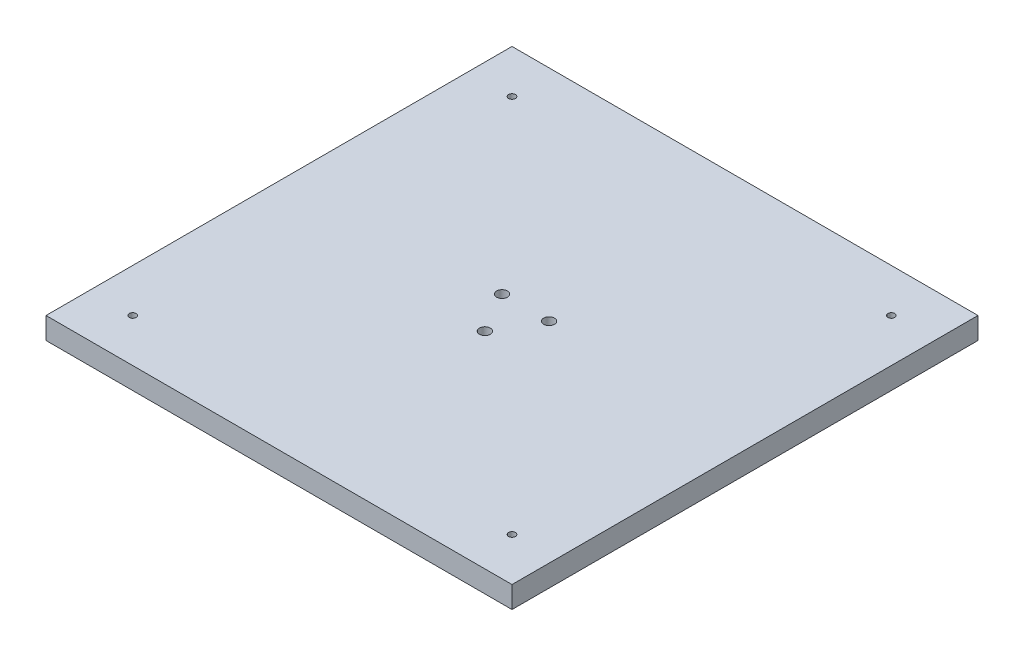
ISO-10303-21;
HEADER;
FILE_DESCRIPTION(('STEP AP214'),'2;1');
FILE_NAME('part.step','',(''),(''),'','','');
FILE_SCHEMA(('AUTOMOTIVE_DESIGN { 1 0 10303 214 1 1 1 1 }'));
ENDSEC;
DATA;
#1=APPLICATION_CONTEXT('core data for automotive mechanical design processes');
#2=APPLICATION_PROTOCOL_DEFINITION('international standard','automotive_design',2000,#1);
#3=PRODUCT_CONTEXT('',#1,'mechanical');
#4=PRODUCT('Part','Part','',(#3));
#5=PRODUCT_RELATED_PRODUCT_CATEGORY('part','',(#4));
#6=PRODUCT_DEFINITION_FORMATION('','',#4);
#7=PRODUCT_DEFINITION_CONTEXT('part definition',#1,'design');
#8=PRODUCT_DEFINITION('design','',#6,#7);
#9=PRODUCT_DEFINITION_SHAPE('','',#8);
#10=(LENGTH_UNIT() NAMED_UNIT(*) SI_UNIT(.MILLI.,.METRE.));
#11=(NAMED_UNIT(*) PLANE_ANGLE_UNIT() SI_UNIT($,.RADIAN.));
#12=(NAMED_UNIT(*) SI_UNIT($,.STERADIAN.) SOLID_ANGLE_UNIT());
#13=UNCERTAINTY_MEASURE_WITH_UNIT(LENGTH_MEASURE(1.E-05),#10,'distance_accuracy_value','');
#14=(GEOMETRIC_REPRESENTATION_CONTEXT(3) GLOBAL_UNCERTAINTY_ASSIGNED_CONTEXT((#13)) GLOBAL_UNIT_ASSIGNED_CONTEXT((#10,
#11,#12)) REPRESENTATION_CONTEXT('',''));
#15=CARTESIAN_POINT('',(0.,0.,0.));
#16=DIRECTION('',(0.,0.,1.));
#17=DIRECTION('',(1.,0.,0.));
#18=AXIS2_PLACEMENT_3D('',#15,#16,#17);
#19=CARTESIAN_POINT('',(0.,70.,0.));
#20=DIRECTION('',(0.,1.,0.));
#21=DIRECTION('',(0.,0.,1.));
#22=AXIS2_PLACEMENT_3D('',#19,#20,#21);
#23=PLANE('',#22);
#24=CARTESIAN_POINT('',(-87.4999999999997,70.,87.5000000000003));
#25=DIRECTION('',(0.,1.,0.));
#26=DIRECTION('',(1.,0.,0.));
#27=AXIS2_PLACEMENT_3D('',#24,#25,#26);
#28=CIRCLE('',#27,1.60000000000001);
#29=CARTESIAN_POINT('',(-85.8999999999997,70.,87.5000000000003));
#30=VERTEX_POINT('',#29);
#31=EDGE_CURVE('E248',#30,#30,#28,.T.);
#32=ORIENTED_EDGE('',*,*,#31,.F.);
#33=EDGE_LOOP('',(#32));
#34=FACE_BOUND('',#33,.T.);
#35=CARTESIAN_POINT('',(87.5,70.,87.5));
#36=DIRECTION('',(0.,1.,0.));
#37=DIRECTION('',(0.,0.,-1.));
#38=AXIS2_PLACEMENT_3D('',#35,#36,#37);
#39=CIRCLE('',#38,1.60000000000001);
#40=CARTESIAN_POINT('',(87.5,70.,85.9));
#41=VERTEX_POINT('',#40);
#42=EDGE_CURVE('E240',#41,#41,#39,.T.);
#43=ORIENTED_EDGE('',*,*,#42,.F.);
#44=EDGE_LOOP('',(#43));
#45=FACE_BOUND('',#44,.T.);
#46=CARTESIAN_POINT('',(87.4999999999991,70.,-87.5000000000009));
#47=DIRECTION('',(0.,1.,0.));
#48=DIRECTION('',(-1.,0.,0.));
#49=AXIS2_PLACEMENT_3D('',#46,#47,#48);
#50=CIRCLE('',#49,1.60000000000001);
#51=CARTESIAN_POINT('',(85.8999999999991,70.,-87.5000000000009));
#52=VERTEX_POINT('',#51);
#53=EDGE_CURVE('E232',#52,#52,#50,.T.);
#54=ORIENTED_EDGE('',*,*,#53,.F.);
#55=EDGE_LOOP('',(#54));
#56=FACE_BOUND('',#55,.T.);
#57=CARTESIAN_POINT('',(-87.5,70.,-87.5));
#58=DIRECTION('',(0.,1.,0.));
#59=DIRECTION('',(0.,0.,1.));
#60=AXIS2_PLACEMENT_3D('',#57,#58,#59);
#61=CIRCLE('',#60,1.60000000000001);
#62=CARTESIAN_POINT('',(-87.5,70.,-85.9));
#63=VERTEX_POINT('',#62);
#64=EDGE_CURVE('E224',#63,#63,#61,.T.);
#65=ORIENTED_EDGE('',*,*,#64,.F.);
#66=EDGE_LOOP('',(#65));
#67=FACE_BOUND('',#66,.T.);
#68=CARTESIAN_POINT('',(0.,70.,12.525));
#69=DIRECTION('',(0.,-1.,0.));
#70=DIRECTION('',(-0.866025403784436,0.,0.500000000000004));
#71=AXIS2_PLACEMENT_3D('',#68,#69,#70);
#72=CIRCLE('',#71,2.5);
#73=CARTESIAN_POINT('',(0.,70.,10.025));
#74=VERTEX_POINT('',#73);
#75=EDGE_CURVE('E167',#74,#74,#72,.T.);
#76=ORIENTED_EDGE('',*,*,#75,.T.);
#77=EDGE_LOOP('',(#76));
#78=FACE_BOUND('',#77,.T.);
#79=CARTESIAN_POINT('',(10.8469681824001,70.,-6.26250000000005));
#80=DIRECTION('',(0.,-1.,0.));
#81=DIRECTION('',(0.866025403784443,0.,0.499999999999992));
#82=AXIS2_PLACEMENT_3D('',#79,#80,#81);
#83=CIRCLE('',#82,2.5);
#84=CARTESIAN_POINT('',(10.8469681824001,70.,-8.76250000000005));
#85=VERTEX_POINT('',#84);
#86=EDGE_CURVE('E168',#85,#85,#83,.T.);
#87=ORIENTED_EDGE('',*,*,#86,.T.);
#88=EDGE_LOOP('',(#87));
#89=FACE_BOUND('',#88,.T.);
#90=CARTESIAN_POINT('',(-10.8469681824001,70.,-6.26250000000005));
#91=DIRECTION('',(0.,-1.,0.));
#92=DIRECTION('',(0.,0.,-1.));
#93=AXIS2_PLACEMENT_3D('',#90,#91,#92);
#94=CIRCLE('',#93,2.5);
#95=CARTESIAN_POINT('',(-10.8469681824001,70.,-8.76250000000004));
#96=VERTEX_POINT('',#95);
#97=EDGE_CURVE('E155',#96,#96,#94,.T.);
#98=ORIENTED_EDGE('',*,*,#97,.T.);
#99=EDGE_LOOP('',(#98));
#100=FACE_BOUND('',#99,.T.);
#101=DIRECTION('',(1.,0.,0.));
#102=VECTOR('',#101,1.);
#103=CARTESIAN_POINT('',(0.,70.,107.5));
#104=LINE('',#103,#102);
#105=CARTESIAN_POINT('',(-107.5,70.,107.5));
#106=VERTEX_POINT('',#105);
#107=CARTESIAN_POINT('',(107.5,70.,107.5));
#108=VERTEX_POINT('',#107);
#109=EDGE_CURVE('E196',#106,#108,#104,.T.);
#110=ORIENTED_EDGE('',*,*,#109,.T.);
#111=DIRECTION('',(0.,0.,-1.));
#112=VECTOR('',#111,1.);
#113=CARTESIAN_POINT('',(107.5,70.,0.));
#114=LINE('',#113,#112);
#115=CARTESIAN_POINT('',(107.5,70.,-107.5));
#116=VERTEX_POINT('',#115);
#117=EDGE_CURVE('E217',#108,#116,#114,.T.);
#118=ORIENTED_EDGE('',*,*,#117,.T.);
#119=DIRECTION('',(1.,0.,0.));
#120=VECTOR('',#119,1.);
#121=CARTESIAN_POINT('',(0.,70.,-107.5));
#122=LINE('',#121,#120);
#123=CARTESIAN_POINT('',(-107.5,70.,-107.5));
#124=VERTEX_POINT('',#123);
#125=EDGE_CURVE('E213',#124,#116,#122,.T.);
#126=ORIENTED_EDGE('',*,*,#125,.F.);
#127=DIRECTION('',(0.,0.,-1.));
#128=VECTOR('',#127,1.);
#129=CARTESIAN_POINT('',(-107.5,70.,0.));
#130=LINE('',#129,#128);
#131=EDGE_CURVE('E191',#106,#124,#130,.T.);
#132=ORIENTED_EDGE('',*,*,#131,.F.);
#133=EDGE_LOOP('',(#110,#118,#126,#132));
#134=FACE_BOUND('',#133,.T.);
#135=ADVANCED_FACE('F57',(#34,#45,#56,#67,#78,#89,#100,#134),#23,.T.);
#136=CARTESIAN_POINT('',(0.,45.,0.));
#137=DIRECTION('',(0.,1.,0.));
#138=DIRECTION('',(0.,0.,1.));
#139=AXIS2_PLACEMENT_3D('',#136,#137,#138);
#140=PLANE('',#139);
#141=CARTESIAN_POINT('',(-10.8469681824001,45.,-6.26250000000005));
#142=DIRECTION('',(0.,1.,0.));
#143=DIRECTION('',(0.,0.,1.));
#144=AXIS2_PLACEMENT_3D('',#141,#142,#143);
#145=CIRCLE('',#144,2.5);
#146=CARTESIAN_POINT('',(-10.8469681824001,45.,-8.76250000000004));
#147=VERTEX_POINT('',#146);
#148=EDGE_CURVE('E145',#147,#147,#145,.T.);
#149=ORIENTED_EDGE('',*,*,#148,.T.);
#150=EDGE_LOOP('',(#149));
#151=FACE_BOUND('',#150,.T.);
#152=CARTESIAN_POINT('',(0.,45.,0.));
#153=DIRECTION('',(0.,1.,0.));
#154=DIRECTION('',(0.,0.,1.));
#155=AXIS2_PLACEMENT_3D('',#152,#153,#154);
#156=CIRCLE('',#155,6.);
#157=CARTESIAN_POINT('',(-2.,45.,-5.65685424949238));
#158=VERTEX_POINT('',#157);
#159=CARTESIAN_POINT('',(2.,45.,-5.65685424949238));
#160=VERTEX_POINT('',#159);
#161=EDGE_CURVE('E142',#158,#160,#156,.T.);
#162=ORIENTED_EDGE('',*,*,#161,.T.);
#163=DIRECTION('',(0.,0.,1.));
#164=VECTOR('',#163,1.);
#165=CARTESIAN_POINT('',(2.,45.,0.));
#166=LINE('',#165,#164);
#167=CARTESIAN_POINT('',(2.,45.,-8.));
#168=VERTEX_POINT('',#167);
#169=EDGE_CURVE('E114',#168,#160,#166,.T.);
#170=ORIENTED_EDGE('',*,*,#169,.F.);
#171=DIRECTION('',(1.,0.,0.));
#172=VECTOR('',#171,1.);
#173=CARTESIAN_POINT('',(0.,45.,-8.));
#174=LINE('',#173,#172);
#175=CARTESIAN_POINT('',(-2.,45.,-8.));
#176=VERTEX_POINT('',#175);
#177=EDGE_CURVE('E110',#176,#168,#174,.T.);
#178=ORIENTED_EDGE('',*,*,#177,.F.);
#179=DIRECTION('',(0.,0.,1.));
#180=VECTOR('',#179,1.);
#181=CARTESIAN_POINT('',(-2.,45.,0.));
#182=LINE('',#181,#180);
#183=EDGE_CURVE('E115',#176,#158,#182,.T.);
#184=ORIENTED_EDGE('',*,*,#183,.T.);
#185=EDGE_LOOP('',(#162,#170,#178,#184));
#186=FACE_BOUND('',#185,.T.);
#187=CARTESIAN_POINT('',(0.,45.,0.));
#188=DIRECTION('',(0.,1.,0.));
#189=DIRECTION('',(0.,0.,1.));
#190=AXIS2_PLACEMENT_3D('',#187,#188,#189);
#191=CIRCLE('',#190,19.05);
#192=CARTESIAN_POINT('',(0.,45.,19.05));
#193=VERTEX_POINT('',#192);
#194=EDGE_CURVE('E126',#193,#193,#191,.T.);
#195=ORIENTED_EDGE('',*,*,#194,.F.);
#196=EDGE_LOOP('',(#195));
#197=FACE_BOUND('',#196,.T.);
#198=CARTESIAN_POINT('',(0.,45.,12.525));
#199=DIRECTION('',(0.,1.,0.));
#200=DIRECTION('',(0.,0.,1.));
#201=AXIS2_PLACEMENT_3D('',#198,#199,#200);
#202=CIRCLE('',#201,2.5);
#203=CARTESIAN_POINT('',(0.,45.,10.025));
#204=VERTEX_POINT('',#203);
#205=EDGE_CURVE('E159',#204,#204,#202,.T.);
#206=ORIENTED_EDGE('',*,*,#205,.T.);
#207=EDGE_LOOP('',(#206));
#208=FACE_BOUND('',#207,.T.);
#209=CARTESIAN_POINT('',(10.8469681824001,45.,-6.26250000000005));
#210=DIRECTION('',(0.,1.,0.));
#211=DIRECTION('',(0.,0.,1.));
#212=AXIS2_PLACEMENT_3D('',#209,#210,#211);
#213=CIRCLE('',#212,2.5);
#214=CARTESIAN_POINT('',(10.8469681824001,45.,-8.76250000000005));
#215=VERTEX_POINT('',#214);
#216=EDGE_CURVE('E163',#215,#215,#213,.T.);
#217=ORIENTED_EDGE('',*,*,#216,.T.);
#218=EDGE_LOOP('',(#217));
#219=FACE_BOUND('',#218,.T.);
#220=ADVANCED_FACE('F268',(#151,#186,#197,#208,#219),#140,.F.);
#221=CARTESIAN_POINT('',(2.,42.,0.));
#222=DIRECTION('',(-1.,0.,0.));
#223=DIRECTION('',(0.,0.,1.));
#224=AXIS2_PLACEMENT_3D('',#221,#222,#223);
#225=PLANE('',#224);
#226=DIRECTION('',(0.,1.,0.));
#227=VECTOR('',#226,1.);
#228=CARTESIAN_POINT('',(2.,42.,-8.));
#229=LINE('',#228,#227);
#230=CARTESIAN_POINT('',(2.,42.,-8.));
#231=VERTEX_POINT('',#230);
#232=EDGE_CURVE('E105',#231,#168,#229,.T.);
#233=ORIENTED_EDGE('',*,*,#232,.T.);
#234=ORIENTED_EDGE('',*,*,#169,.T.);
#235=DIRECTION('',(0.,1.,0.));
#236=VECTOR('',#235,1.);
#237=CARTESIAN_POINT('',(2.,42.,-5.65685424949238));
#238=LINE('',#237,#236);
#239=CARTESIAN_POINT('',(2.,42.,-5.65685424949238));
#240=VERTEX_POINT('',#239);
#241=EDGE_CURVE('E76',#240,#160,#238,.T.);
#242=ORIENTED_EDGE('',*,*,#241,.F.);
#243=DIRECTION('',(0.,0.,1.));
#244=VECTOR('',#243,1.);
#245=CARTESIAN_POINT('',(2.,42.,0.));
#246=LINE('',#245,#244);
#247=EDGE_CURVE('E11',#231,#240,#246,.T.);
#248=ORIENTED_EDGE('',*,*,#247,.F.);
#249=EDGE_LOOP('',(#233,#234,#242,#248));
#250=FACE_BOUND('',#249,.T.);
#251=ADVANCED_FACE('F117',(#250),#225,.F.);
#252=CARTESIAN_POINT('',(0.,42.,-8.));
#253=DIRECTION('',(0.,0.,1.));
#254=DIRECTION('',(1.,0.,0.));
#255=AXIS2_PLACEMENT_3D('',#252,#253,#254);
#256=PLANE('',#255);
#257=DIRECTION('',(0.,1.,0.));
#258=VECTOR('',#257,1.);
#259=CARTESIAN_POINT('',(-2.,42.,-8.));
#260=LINE('',#259,#258);
#261=CARTESIAN_POINT('',(-2.,42.,-8.));
#262=VERTEX_POINT('',#261);
#263=EDGE_CURVE('E99',#262,#176,#260,.T.);
#264=ORIENTED_EDGE('',*,*,#263,.T.);
#265=ORIENTED_EDGE('',*,*,#177,.T.);
#266=ORIENTED_EDGE('',*,*,#232,.F.);
#267=DIRECTION('',(1.,0.,0.));
#268=VECTOR('',#267,1.);
#269=CARTESIAN_POINT('',(0.,42.,-8.));
#270=LINE('',#269,#268);
#271=EDGE_CURVE('E68',#262,#231,#270,.T.);
#272=ORIENTED_EDGE('',*,*,#271,.F.);
#273=EDGE_LOOP('',(#264,#265,#266,#272));
#274=FACE_BOUND('',#273,.T.);
#275=ADVANCED_FACE('F107',(#274),#256,.F.);
#276=CARTESIAN_POINT('',(-2.,42.,0.));
#277=DIRECTION('',(-1.,0.,0.));
#278=DIRECTION('',(0.,0.,1.));
#279=AXIS2_PLACEMENT_3D('',#276,#277,#278);
#280=PLANE('',#279);
#281=ORIENTED_EDGE('',*,*,#183,.F.);
#282=ORIENTED_EDGE('',*,*,#263,.F.);
#283=DIRECTION('',(0.,0.,1.));
#284=VECTOR('',#283,1.);
#285=CARTESIAN_POINT('',(-2.,42.,0.));
#286=LINE('',#285,#284);
#287=CARTESIAN_POINT('',(-2.,42.,-5.65685424949238));
#288=VERTEX_POINT('',#287);
#289=EDGE_CURVE('E120',#262,#288,#286,.T.);
#290=ORIENTED_EDGE('',*,*,#289,.T.);
#291=DIRECTION('',(0.,1.,0.));
#292=VECTOR('',#291,1.);
#293=CARTESIAN_POINT('',(-2.,42.,-5.65685424949238));
#294=LINE('',#293,#292);
#295=EDGE_CURVE('E131',#288,#158,#294,.T.);
#296=ORIENTED_EDGE('',*,*,#295,.T.);
#297=EDGE_LOOP('',(#281,#282,#290,#296));
#298=FACE_BOUND('',#297,.T.);
#299=ADVANCED_FACE('F354',(#298),#280,.T.);
#300=CARTESIAN_POINT('',(0.,42.,0.));
#301=DIRECTION('',(0.,1.,0.));
#302=DIRECTION('',(0.,0.,1.));
#303=AXIS2_PLACEMENT_3D('',#300,#301,#302);
#304=CYLINDRICAL_SURFACE('',#303,6.);
#305=ORIENTED_EDGE('',*,*,#161,.F.);
#306=ORIENTED_EDGE('',*,*,#295,.F.);
#307=CARTESIAN_POINT('',(0.,42.,0.));
#308=DIRECTION('',(0.,1.,0.));
#309=DIRECTION('',(0.,0.,1.));
#310=AXIS2_PLACEMENT_3D('',#307,#308,#309);
#311=CIRCLE('',#310,6.);
#312=EDGE_CURVE('E61',#288,#240,#311,.T.);
#313=ORIENTED_EDGE('',*,*,#312,.T.);
#314=ORIENTED_EDGE('',*,*,#241,.T.);
#315=EDGE_LOOP('',(#305,#306,#313,#314));
#316=FACE_BOUND('',#315,.T.);
#317=ADVANCED_FACE('F347',(#316),#304,.T.);
#318=CARTESIAN_POINT('',(0.,45.,0.));
#319=DIRECTION('',(0.,1.,0.));
#320=DIRECTION('',(0.,0.,1.));
#321=AXIS2_PLACEMENT_3D('',#318,#319,#320);
#322=CYLINDRICAL_SURFACE('',#321,19.05);
#323=ORIENTED_EDGE('',*,*,#194,.T.);
#324=EDGE_LOOP('',(#323));
#325=FACE_BOUND('',#324,.T.);
#326=CARTESIAN_POINT('',(0.,60.,0.));
#327=DIRECTION('',(0.,1.,0.));
#328=DIRECTION('',(0.,0.,1.));
#329=AXIS2_PLACEMENT_3D('',#326,#327,#328);
#330=CIRCLE('',#329,19.05);
#331=CARTESIAN_POINT('',(0.,60.,19.05));
#332=VERTEX_POINT('',#331);
#333=EDGE_CURVE('E122',#332,#332,#330,.T.);
#334=ORIENTED_EDGE('',*,*,#333,.F.);
#335=EDGE_LOOP('',(#334));
#336=FACE_BOUND('',#335,.T.);
#337=ADVANCED_FACE('F344',(#325,#336),#322,.T.);
#338=CARTESIAN_POINT('',(0.,60.,0.));
#339=DIRECTION('',(0.,1.,0.));
#340=DIRECTION('',(0.,0.,1.));
#341=AXIS2_PLACEMENT_3D('',#338,#339,#340);
#342=PLANE('',#341);
#343=CARTESIAN_POINT('',(-87.4999999999997,60.,87.5000000000003));
#344=DIRECTION('',(0.,1.,0.));
#345=DIRECTION('',(1.,0.,0.));
#346=AXIS2_PLACEMENT_3D('',#343,#344,#345);
#347=CIRCLE('',#346,1.60000000000001);
#348=CARTESIAN_POINT('',(-85.8999999999997,60.,87.5000000000003));
#349=VERTEX_POINT('',#348);
#350=EDGE_CURVE('E228',#349,#349,#347,.T.);
#351=ORIENTED_EDGE('',*,*,#350,.T.);
#352=EDGE_LOOP('',(#351));
#353=FACE_BOUND('',#352,.T.);
#354=CARTESIAN_POINT('',(87.5,60.,87.5));
#355=DIRECTION('',(0.,1.,0.));
#356=DIRECTION('',(0.,0.,-1.));
#357=AXIS2_PLACEMENT_3D('',#354,#355,#356);
#358=CIRCLE('',#357,1.60000000000001);
#359=CARTESIAN_POINT('',(87.5,60.,85.9));
#360=VERTEX_POINT('',#359);
#361=EDGE_CURVE('E244',#360,#360,#358,.T.);
#362=ORIENTED_EDGE('',*,*,#361,.T.);
#363=EDGE_LOOP('',(#362));
#364=FACE_BOUND('',#363,.T.);
#365=CARTESIAN_POINT('',(87.4999999999991,60.,-87.5000000000009));
#366=DIRECTION('',(0.,1.,0.));
#367=DIRECTION('',(-1.,0.,0.));
#368=AXIS2_PLACEMENT_3D('',#365,#366,#367);
#369=CIRCLE('',#368,1.60000000000001);
#370=CARTESIAN_POINT('',(85.8999999999991,60.,-87.5000000000009));
#371=VERTEX_POINT('',#370);
#372=EDGE_CURVE('E236',#371,#371,#369,.T.);
#373=ORIENTED_EDGE('',*,*,#372,.T.);
#374=EDGE_LOOP('',(#373));
#375=FACE_BOUND('',#374,.T.);
#376=CARTESIAN_POINT('',(-87.5,60.,-87.5));
#377=DIRECTION('',(0.,1.,0.));
#378=DIRECTION('',(0.,0.,1.));
#379=AXIS2_PLACEMENT_3D('',#376,#377,#378);
#380=CIRCLE('',#379,1.60000000000001);
#381=CARTESIAN_POINT('',(-87.5,60.,-85.9));
#382=VERTEX_POINT('',#381);
#383=EDGE_CURVE('E209',#382,#382,#380,.T.);
#384=ORIENTED_EDGE('',*,*,#383,.T.);
#385=EDGE_LOOP('',(#384));
#386=FACE_BOUND('',#385,.T.);
#387=ORIENTED_EDGE('',*,*,#333,.T.);
#388=EDGE_LOOP('',(#387));
#389=FACE_BOUND('',#388,.T.);
#390=DIRECTION('',(1.,0.,0.));
#391=VECTOR('',#390,1.);
#392=CARTESIAN_POINT('',(0.,60.,107.5));
#393=LINE('',#392,#391);
#394=CARTESIAN_POINT('',(-107.5,60.,107.5));
#395=VERTEX_POINT('',#394);
#396=CARTESIAN_POINT('',(107.5,60.,107.5));
#397=VERTEX_POINT('',#396);
#398=EDGE_CURVE('E205',#395,#397,#393,.T.);
#399=ORIENTED_EDGE('',*,*,#398,.F.);
#400=DIRECTION('',(0.,0.,-1.));
#401=VECTOR('',#400,1.);
#402=CARTESIAN_POINT('',(-107.5,60.,0.));
#403=LINE('',#402,#401);
#404=CARTESIAN_POINT('',(-107.5,60.,-107.5));
#405=VERTEX_POINT('',#404);
#406=EDGE_CURVE('E192',#395,#405,#403,.T.);
#407=ORIENTED_EDGE('',*,*,#406,.T.);
#408=DIRECTION('',(1.,0.,0.));
#409=VECTOR('',#408,1.);
#410=CARTESIAN_POINT('',(0.,60.,-107.5));
#411=LINE('',#410,#409);
#412=CARTESIAN_POINT('',(107.5,60.,-107.5));
#413=VERTEX_POINT('',#412);
#414=EDGE_CURVE('E197',#405,#413,#411,.T.);
#415=ORIENTED_EDGE('',*,*,#414,.T.);
#416=DIRECTION('',(0.,0.,-1.));
#417=VECTOR('',#416,1.);
#418=CARTESIAN_POINT('',(107.5,60.,0.));
#419=LINE('',#418,#417);
#420=EDGE_CURVE('E201',#397,#413,#419,.T.);
#421=ORIENTED_EDGE('',*,*,#420,.F.);
#422=EDGE_LOOP('',(#399,#407,#415,#421));
#423=FACE_BOUND('',#422,.T.);
#424=ADVANCED_FACE('F256',(#353,#364,#375,#386,#389,#423),#342,.F.);
#425=CARTESIAN_POINT('',(0.,42.,0.));
#426=DIRECTION('',(0.,1.,0.));
#427=DIRECTION('',(0.,0.,1.));
#428=AXIS2_PLACEMENT_3D('',#425,#426,#427);
#429=PLANE('',#428);
#430=ORIENTED_EDGE('',*,*,#312,.F.);
#431=ORIENTED_EDGE('',*,*,#289,.F.);
#432=ORIENTED_EDGE('',*,*,#271,.T.);
#433=ORIENTED_EDGE('',*,*,#247,.T.);
#434=EDGE_LOOP('',(#430,#431,#432,#433));
#435=FACE_BOUND('',#434,.T.);
#436=ADVANCED_FACE('F59',(#435),#429,.F.);
#437=CARTESIAN_POINT('',(-10.8469681824001,70.,-6.26250000000005));
#438=DIRECTION('',(0.,-1.,0.));
#439=DIRECTION('',(0.,0.,-1.));
#440=AXIS2_PLACEMENT_3D('',#437,#438,#439);
#441=CYLINDRICAL_SURFACE('',#440,2.5);
#442=CARTESIAN_POINT('',(-10.8469681824001,70.,-8.76250000000004));
#443=CARTESIAN_POINT('',(-10.8469681824001,69.7395833333333,-8.76250000000004));
#444=CARTESIAN_POINT('',(-10.8469681824001,69.4791666666667,-8.76250000000004));
#445=CARTESIAN_POINT('',(-10.8469681824001,68.9583333333333,-8.76250000000004));
#446=CARTESIAN_POINT('',(-10.8469681824001,68.6979166666667,-8.76250000000004));
#447=CARTESIAN_POINT('',(-10.8469681824001,68.1770833333333,-8.76250000000004));
#448=CARTESIAN_POINT('',(-10.8469681824001,67.9166666666667,-8.76250000000004));
#449=CARTESIAN_POINT('',(-10.8469681824001,67.3958333333333,-8.76250000000004));
#450=CARTESIAN_POINT('',(-10.8469681824001,67.1354166666667,-8.76250000000004));
#451=CARTESIAN_POINT('',(-10.8469681824001,66.6145833333333,-8.76250000000004));
#452=CARTESIAN_POINT('',(-10.8469681824001,66.3541666666667,-8.76250000000004));
#453=CARTESIAN_POINT('',(-10.8469681824001,65.8333333333333,-8.76250000000004));
#454=CARTESIAN_POINT('',(-10.8469681824001,65.5729166666667,-8.76250000000004));
#455=CARTESIAN_POINT('',(-10.8469681824001,65.0520833333333,-8.76250000000004));
#456=CARTESIAN_POINT('',(-10.8469681824001,64.7916666666667,-8.76250000000004));
#457=CARTESIAN_POINT('',(-10.8469681824001,64.2708333333333,-8.76250000000004));
#458=CARTESIAN_POINT('',(-10.8469681824001,64.0104166666667,-8.76250000000004));
#459=CARTESIAN_POINT('',(-10.8469681824001,63.4895833333333,-8.76250000000004));
#460=CARTESIAN_POINT('',(-10.8469681824001,63.2291666666667,-8.76250000000004));
#461=CARTESIAN_POINT('',(-10.8469681824001,62.7083333333333,-8.76250000000004));
#462=CARTESIAN_POINT('',(-10.8469681824001,62.4479166666667,-8.76250000000004));
#463=CARTESIAN_POINT('',(-10.8469681824001,61.9270833333333,-8.76250000000004));
#464=CARTESIAN_POINT('',(-10.8469681824001,61.6666666666667,-8.76250000000004));
#465=CARTESIAN_POINT('',(-10.8469681824001,61.1458333333333,-8.76250000000004));
#466=CARTESIAN_POINT('',(-10.8469681824001,60.8854166666667,-8.76250000000004));
#467=CARTESIAN_POINT('',(-10.8469681824001,60.3645833333333,-8.76250000000004));
#468=CARTESIAN_POINT('',(-10.8469681824001,60.1041666666667,-8.76250000000004));
#469=CARTESIAN_POINT('',(-10.8469681824001,59.5833333333333,-8.76250000000004));
#470=CARTESIAN_POINT('',(-10.8469681824001,59.3229166666667,-8.76250000000004));
#471=CARTESIAN_POINT('',(-10.8469681824001,58.8020833333333,-8.76250000000004));
#472=CARTESIAN_POINT('',(-10.8469681824001,58.5416666666667,-8.76250000000004));
#473=CARTESIAN_POINT('',(-10.8469681824001,58.0208333333333,-8.76250000000004));
#474=CARTESIAN_POINT('',(-10.8469681824001,57.7604166666667,-8.76250000000004));
#475=CARTESIAN_POINT('',(-10.8469681824001,57.2395833333333,-8.76250000000004));
#476=CARTESIAN_POINT('',(-10.8469681824001,56.9791666666667,-8.76250000000004));
#477=CARTESIAN_POINT('',(-10.8469681824001,56.4583333333333,-8.76250000000004));
#478=CARTESIAN_POINT('',(-10.8469681824001,56.1979166666667,-8.76250000000004));
#479=CARTESIAN_POINT('',(-10.8469681824001,55.6770833333333,-8.76250000000004));
#480=CARTESIAN_POINT('',(-10.8469681824001,55.4166666666667,-8.76250000000004));
#481=CARTESIAN_POINT('',(-10.8469681824001,54.8958333333333,-8.76250000000004));
#482=CARTESIAN_POINT('',(-10.8469681824001,54.6354166666667,-8.76250000000004));
#483=CARTESIAN_POINT('',(-10.8469681824001,54.1145833333333,-8.76250000000004));
#484=CARTESIAN_POINT('',(-10.8469681824001,53.8541666666667,-8.76250000000004));
#485=CARTESIAN_POINT('',(-10.8469681824001,53.3333333333333,-8.76250000000004));
#486=CARTESIAN_POINT('',(-10.8469681824001,53.0729166666667,-8.76250000000004));
#487=CARTESIAN_POINT('',(-10.8469681824001,52.5520833333333,-8.76250000000004));
#488=CARTESIAN_POINT('',(-10.8469681824001,52.2916666666667,-8.76250000000004));
#489=CARTESIAN_POINT('',(-10.8469681824001,51.7708333333333,-8.76250000000004));
#490=CARTESIAN_POINT('',(-10.8469681824001,51.5104166666667,-8.76250000000004));
#491=CARTESIAN_POINT('',(-10.8469681824001,50.9895833333333,-8.76250000000004));
#492=CARTESIAN_POINT('',(-10.8469681824001,50.7291666666667,-8.76250000000004));
#493=CARTESIAN_POINT('',(-10.8469681824001,50.2083333333333,-8.76250000000004));
#494=CARTESIAN_POINT('',(-10.8469681824001,49.9479166666667,-8.76250000000004));
#495=CARTESIAN_POINT('',(-10.8469681824001,49.4270833333333,-8.76250000000004));
#496=CARTESIAN_POINT('',(-10.8469681824001,49.1666666666667,-8.76250000000004));
#497=CARTESIAN_POINT('',(-10.8469681824001,48.6458333333333,-8.76250000000004));
#498=CARTESIAN_POINT('',(-10.8469681824001,48.3854166666667,-8.76250000000004));
#499=CARTESIAN_POINT('',(-10.8469681824001,47.8645833333333,-8.76250000000004));
#500=CARTESIAN_POINT('',(-10.8469681824001,47.6041666666667,-8.76250000000004));
#501=CARTESIAN_POINT('',(-10.8469681824001,47.0833333333333,-8.76250000000004));
#502=CARTESIAN_POINT('',(-10.8469681824001,46.8229166666667,-8.76250000000004));
#503=CARTESIAN_POINT('',(-10.8469681824001,46.3020833333333,-8.76250000000004));
#504=CARTESIAN_POINT('',(-10.8469681824001,46.0416666666667,-8.76250000000004));
#505=CARTESIAN_POINT('',(-10.8469681824001,45.5208333333333,-8.76250000000004));
#506=CARTESIAN_POINT('',(-10.8469681824001,45.2604166666667,-8.76250000000004));
#507=CARTESIAN_POINT('',(-10.8469681824001,45.,-8.76250000000004));
#508=B_SPLINE_CURVE_WITH_KNOTS('',3,(#442,#443,#444,#445,#446,#447,#448,#449,#450,#451,#452,
#453,#454,#455,#456,#457,#458,#459,#460,#461,#462,#463,#464,#465,#466,#467,#468,#469,#470,#471,
#472,#473,#474,#475,#476,#477,#478,#479,#480,#481,#482,#483,#484,#485,#486,#487,#488,#489,#490,
#491,#492,#493,#494,#495,#496,#497,#498,#499,#500,#501,#502,#503,#504,#505,#506,#507),
.UNSPECIFIED.,.F.,.F.,(4,2,2,2,2,2,2,2,2,2,2,2,2,2,2,2,2,2,2,2,2,2,2,2,2,2,2,2,2,2,2,2,4),(0.,
0.781250000000011,1.56250000000001,2.34375000000001,3.125,3.90625000000001,4.68750000000001,
5.46875000000001,6.25000000000001,7.03125,7.81250000000001,8.59375000000001,9.37500000000001,
10.15625,10.9375,11.71875,12.5,13.28125,14.0625,14.84375,15.625,16.40625,17.1875,17.96875,18.75,
19.53125,20.3125,21.09375,21.875,22.65625,23.4375,24.21875,25.),.UNSPECIFIED.);
#509=EDGE_CURVE('BSEAM337',#96,#147,#508,.T.);
#510=ORIENTED_EDGE('',*,*,#97,.F.);
#511=ORIENTED_EDGE('',*,*,#148,.F.);
#512=ORIENTED_EDGE('',*,*,#509,.T.);
#513=ORIENTED_EDGE('',*,*,#509,.F.);
#514=EDGE_LOOP('',(#510,#512,#511,#513));
#515=FACE_BOUND('',#514,.T.);
#516=ADVANCED_FACE('F337',(#515),#441,.F.);
#517=CARTESIAN_POINT('',(10.8469681824001,70.,-6.26250000000005));
#518=DIRECTION('',(0.,-1.,0.));
#519=DIRECTION('',(0.,0.,-1.));
#520=AXIS2_PLACEMENT_3D('',#517,#518,#519);
#521=CYLINDRICAL_SURFACE('',#520,2.5);
#522=CARTESIAN_POINT('',(10.8469681824001,70.,-8.76250000000005));
#523=CARTESIAN_POINT('',(10.8469681824001,69.7395833333333,-8.76250000000005));
#524=CARTESIAN_POINT('',(10.8469681824001,69.4791666666667,-8.76250000000005));
#525=CARTESIAN_POINT('',(10.8469681824001,68.9583333333333,-8.76250000000005));
#526=CARTESIAN_POINT('',(10.8469681824001,68.6979166666667,-8.76250000000005));
#527=CARTESIAN_POINT('',(10.8469681824001,68.1770833333333,-8.76250000000005));
#528=CARTESIAN_POINT('',(10.8469681824001,67.9166666666667,-8.76250000000005));
#529=CARTESIAN_POINT('',(10.8469681824001,67.3958333333333,-8.76250000000005));
#530=CARTESIAN_POINT('',(10.8469681824001,67.1354166666667,-8.76250000000005));
#531=CARTESIAN_POINT('',(10.8469681824001,66.6145833333333,-8.76250000000005));
#532=CARTESIAN_POINT('',(10.8469681824001,66.3541666666667,-8.76250000000005));
#533=CARTESIAN_POINT('',(10.8469681824001,65.8333333333333,-8.76250000000005));
#534=CARTESIAN_POINT('',(10.8469681824001,65.5729166666667,-8.76250000000005));
#535=CARTESIAN_POINT('',(10.8469681824001,65.0520833333333,-8.76250000000005));
#536=CARTESIAN_POINT('',(10.8469681824001,64.7916666666667,-8.76250000000005));
#537=CARTESIAN_POINT('',(10.8469681824001,64.2708333333333,-8.76250000000005));
#538=CARTESIAN_POINT('',(10.8469681824001,64.0104166666667,-8.76250000000005));
#539=CARTESIAN_POINT('',(10.8469681824001,63.4895833333333,-8.76250000000005));
#540=CARTESIAN_POINT('',(10.8469681824001,63.2291666666667,-8.76250000000005));
#541=CARTESIAN_POINT('',(10.8469681824001,62.7083333333333,-8.76250000000005));
#542=CARTESIAN_POINT('',(10.8469681824001,62.4479166666667,-8.76250000000005));
#543=CARTESIAN_POINT('',(10.8469681824001,61.9270833333333,-8.76250000000005));
#544=CARTESIAN_POINT('',(10.8469681824001,61.6666666666667,-8.76250000000005));
#545=CARTESIAN_POINT('',(10.8469681824001,61.1458333333333,-8.76250000000005));
#546=CARTESIAN_POINT('',(10.8469681824001,60.8854166666667,-8.76250000000005));
#547=CARTESIAN_POINT('',(10.8469681824001,60.3645833333333,-8.76250000000005));
#548=CARTESIAN_POINT('',(10.8469681824001,60.1041666666667,-8.76250000000005));
#549=CARTESIAN_POINT('',(10.8469681824001,59.5833333333333,-8.76250000000005));
#550=CARTESIAN_POINT('',(10.8469681824001,59.3229166666667,-8.76250000000005));
#551=CARTESIAN_POINT('',(10.8469681824001,58.8020833333333,-8.76250000000005));
#552=CARTESIAN_POINT('',(10.8469681824001,58.5416666666667,-8.76250000000005));
#553=CARTESIAN_POINT('',(10.8469681824001,58.0208333333333,-8.76250000000005));
#554=CARTESIAN_POINT('',(10.8469681824001,57.7604166666667,-8.76250000000005));
#555=CARTESIAN_POINT('',(10.8469681824001,57.2395833333333,-8.76250000000005));
#556=CARTESIAN_POINT('',(10.8469681824001,56.9791666666667,-8.76250000000005));
#557=CARTESIAN_POINT('',(10.8469681824001,56.4583333333333,-8.76250000000005));
#558=CARTESIAN_POINT('',(10.8469681824001,56.1979166666667,-8.76250000000005));
#559=CARTESIAN_POINT('',(10.8469681824001,55.6770833333333,-8.76250000000005));
#560=CARTESIAN_POINT('',(10.8469681824001,55.4166666666667,-8.76250000000005));
#561=CARTESIAN_POINT('',(10.8469681824001,54.8958333333333,-8.76250000000005));
#562=CARTESIAN_POINT('',(10.8469681824001,54.6354166666667,-8.76250000000005));
#563=CARTESIAN_POINT('',(10.8469681824001,54.1145833333333,-8.76250000000005));
#564=CARTESIAN_POINT('',(10.8469681824001,53.8541666666667,-8.76250000000005));
#565=CARTESIAN_POINT('',(10.8469681824001,53.3333333333333,-8.76250000000005));
#566=CARTESIAN_POINT('',(10.8469681824001,53.0729166666667,-8.76250000000005));
#567=CARTESIAN_POINT('',(10.8469681824001,52.5520833333333,-8.76250000000005));
#568=CARTESIAN_POINT('',(10.8469681824001,52.2916666666667,-8.76250000000005));
#569=CARTESIAN_POINT('',(10.8469681824001,51.7708333333333,-8.76250000000005));
#570=CARTESIAN_POINT('',(10.8469681824001,51.5104166666667,-8.76250000000005));
#571=CARTESIAN_POINT('',(10.8469681824001,50.9895833333333,-8.76250000000005));
#572=CARTESIAN_POINT('',(10.8469681824001,50.7291666666667,-8.76250000000005));
#573=CARTESIAN_POINT('',(10.8469681824001,50.2083333333333,-8.76250000000005));
#574=CARTESIAN_POINT('',(10.8469681824001,49.9479166666667,-8.76250000000005));
#575=CARTESIAN_POINT('',(10.8469681824001,49.4270833333333,-8.76250000000005));
#576=CARTESIAN_POINT('',(10.8469681824001,49.1666666666667,-8.76250000000005));
#577=CARTESIAN_POINT('',(10.8469681824001,48.6458333333333,-8.76250000000005));
#578=CARTESIAN_POINT('',(10.8469681824001,48.3854166666667,-8.76250000000005));
#579=CARTESIAN_POINT('',(10.8469681824001,47.8645833333333,-8.76250000000005));
#580=CARTESIAN_POINT('',(10.8469681824001,47.6041666666667,-8.76250000000005));
#581=CARTESIAN_POINT('',(10.8469681824001,47.0833333333333,-8.76250000000005));
#582=CARTESIAN_POINT('',(10.8469681824001,46.8229166666667,-8.76250000000005));
#583=CARTESIAN_POINT('',(10.8469681824001,46.3020833333333,-8.76250000000005));
#584=CARTESIAN_POINT('',(10.8469681824001,46.0416666666667,-8.76250000000005));
#585=CARTESIAN_POINT('',(10.8469681824001,45.5208333333333,-8.76250000000005));
#586=CARTESIAN_POINT('',(10.8469681824001,45.2604166666667,-8.76250000000005));
#587=CARTESIAN_POINT('',(10.8469681824001,45.,-8.76250000000005));
#588=B_SPLINE_CURVE_WITH_KNOTS('',3,(#522,#523,#524,#525,#526,#527,#528,#529,#530,#531,#532,
#533,#534,#535,#536,#537,#538,#539,#540,#541,#542,#543,#544,#545,#546,#547,#548,#549,#550,#551,
#552,#553,#554,#555,#556,#557,#558,#559,#560,#561,#562,#563,#564,#565,#566,#567,#568,#569,#570,
#571,#572,#573,#574,#575,#576,#577,#578,#579,#580,#581,#582,#583,#584,#585,#586,#587),
.UNSPECIFIED.,.F.,.F.,(4,2,2,2,2,2,2,2,2,2,2,2,2,2,2,2,2,2,2,2,2,2,2,2,2,2,2,2,2,2,2,2,4),(0.,
0.781250000000011,1.56250000000001,2.34375000000001,3.125,3.90625000000001,4.68750000000001,
5.46875000000001,6.25000000000001,7.03125,7.81250000000001,8.59375000000001,9.37500000000001,
10.15625,10.9375,11.71875,12.5,13.28125,14.0625,14.84375,15.625,16.40625,17.1875,17.96875,18.75,
19.53125,20.3125,21.09375,21.875,22.65625,23.4375,24.21875,25.),.UNSPECIFIED.);
#589=EDGE_CURVE('BSEAM333',#85,#215,#588,.T.);
#590=ORIENTED_EDGE('',*,*,#86,.F.);
#591=ORIENTED_EDGE('',*,*,#216,.F.);
#592=ORIENTED_EDGE('',*,*,#589,.T.);
#593=ORIENTED_EDGE('',*,*,#589,.F.);
#594=EDGE_LOOP('',(#590,#592,#591,#593));
#595=FACE_BOUND('',#594,.T.);
#596=ADVANCED_FACE('F333',(#595),#521,.F.);
#597=CARTESIAN_POINT('',(0.,70.,12.525));
#598=DIRECTION('',(0.,-1.,0.));
#599=DIRECTION('',(0.,0.,-1.));
#600=AXIS2_PLACEMENT_3D('',#597,#598,#599);
#601=CYLINDRICAL_SURFACE('',#600,2.5);
#602=CARTESIAN_POINT('',(0.,70.,10.025));
#603=CARTESIAN_POINT('',(0.,69.7395833333333,10.025));
#604=CARTESIAN_POINT('',(0.,69.4791666666667,10.025));
#605=CARTESIAN_POINT('',(0.,68.9583333333333,10.025));
#606=CARTESIAN_POINT('',(0.,68.6979166666667,10.025));
#607=CARTESIAN_POINT('',(0.,68.1770833333333,10.025));
#608=CARTESIAN_POINT('',(0.,67.9166666666667,10.025));
#609=CARTESIAN_POINT('',(0.,67.3958333333333,10.025));
#610=CARTESIAN_POINT('',(0.,67.1354166666667,10.025));
#611=CARTESIAN_POINT('',(0.,66.6145833333333,10.025));
#612=CARTESIAN_POINT('',(0.,66.3541666666667,10.025));
#613=CARTESIAN_POINT('',(0.,65.8333333333333,10.025));
#614=CARTESIAN_POINT('',(0.,65.5729166666667,10.025));
#615=CARTESIAN_POINT('',(0.,65.0520833333333,10.025));
#616=CARTESIAN_POINT('',(0.,64.7916666666667,10.025));
#617=CARTESIAN_POINT('',(0.,64.2708333333333,10.025));
#618=CARTESIAN_POINT('',(0.,64.0104166666667,10.025));
#619=CARTESIAN_POINT('',(0.,63.4895833333333,10.025));
#620=CARTESIAN_POINT('',(0.,63.2291666666667,10.025));
#621=CARTESIAN_POINT('',(0.,62.7083333333333,10.025));
#622=CARTESIAN_POINT('',(0.,62.4479166666667,10.025));
#623=CARTESIAN_POINT('',(0.,61.9270833333333,10.025));
#624=CARTESIAN_POINT('',(0.,61.6666666666667,10.025));
#625=CARTESIAN_POINT('',(0.,61.1458333333333,10.025));
#626=CARTESIAN_POINT('',(0.,60.8854166666667,10.025));
#627=CARTESIAN_POINT('',(0.,60.3645833333333,10.025));
#628=CARTESIAN_POINT('',(0.,60.1041666666667,10.025));
#629=CARTESIAN_POINT('',(0.,59.5833333333333,10.025));
#630=CARTESIAN_POINT('',(0.,59.3229166666667,10.025));
#631=CARTESIAN_POINT('',(0.,58.8020833333333,10.025));
#632=CARTESIAN_POINT('',(0.,58.5416666666667,10.025));
#633=CARTESIAN_POINT('',(0.,58.0208333333333,10.025));
#634=CARTESIAN_POINT('',(0.,57.7604166666667,10.025));
#635=CARTESIAN_POINT('',(0.,57.2395833333333,10.025));
#636=CARTESIAN_POINT('',(0.,56.9791666666667,10.025));
#637=CARTESIAN_POINT('',(0.,56.4583333333333,10.025));
#638=CARTESIAN_POINT('',(0.,56.1979166666667,10.025));
#639=CARTESIAN_POINT('',(0.,55.6770833333333,10.025));
#640=CARTESIAN_POINT('',(0.,55.4166666666667,10.025));
#641=CARTESIAN_POINT('',(0.,54.8958333333333,10.025));
#642=CARTESIAN_POINT('',(0.,54.6354166666667,10.025));
#643=CARTESIAN_POINT('',(0.,54.1145833333333,10.025));
#644=CARTESIAN_POINT('',(0.,53.8541666666667,10.025));
#645=CARTESIAN_POINT('',(0.,53.3333333333333,10.025));
#646=CARTESIAN_POINT('',(0.,53.0729166666667,10.025));
#647=CARTESIAN_POINT('',(0.,52.5520833333333,10.025));
#648=CARTESIAN_POINT('',(0.,52.2916666666667,10.025));
#649=CARTESIAN_POINT('',(0.,51.7708333333333,10.025));
#650=CARTESIAN_POINT('',(0.,51.5104166666667,10.025));
#651=CARTESIAN_POINT('',(0.,50.9895833333333,10.025));
#652=CARTESIAN_POINT('',(0.,50.7291666666667,10.025));
#653=CARTESIAN_POINT('',(0.,50.2083333333333,10.025));
#654=CARTESIAN_POINT('',(0.,49.9479166666667,10.025));
#655=CARTESIAN_POINT('',(0.,49.4270833333333,10.025));
#656=CARTESIAN_POINT('',(0.,49.1666666666667,10.025));
#657=CARTESIAN_POINT('',(0.,48.6458333333333,10.025));
#658=CARTESIAN_POINT('',(0.,48.3854166666667,10.025));
#659=CARTESIAN_POINT('',(0.,47.8645833333333,10.025));
#660=CARTESIAN_POINT('',(0.,47.6041666666667,10.025));
#661=CARTESIAN_POINT('',(0.,47.0833333333333,10.025));
#662=CARTESIAN_POINT('',(0.,46.8229166666667,10.025));
#663=CARTESIAN_POINT('',(0.,46.3020833333333,10.025));
#664=CARTESIAN_POINT('',(0.,46.0416666666667,10.025));
#665=CARTESIAN_POINT('',(0.,45.5208333333333,10.025));
#666=CARTESIAN_POINT('',(0.,45.2604166666667,10.025));
#667=CARTESIAN_POINT('',(0.,45.,10.025));
#668=B_SPLINE_CURVE_WITH_KNOTS('',3,(#602,#603,#604,#605,#606,#607,#608,#609,#610,#611,#612,
#613,#614,#615,#616,#617,#618,#619,#620,#621,#622,#623,#624,#625,#626,#627,#628,#629,#630,#631,
#632,#633,#634,#635,#636,#637,#638,#639,#640,#641,#642,#643,#644,#645,#646,#647,#648,#649,#650,
#651,#652,#653,#654,#655,#656,#657,#658,#659,#660,#661,#662,#663,#664,#665,#666,#667),
.UNSPECIFIED.,.F.,.F.,(4,2,2,2,2,2,2,2,2,2,2,2,2,2,2,2,2,2,2,2,2,2,2,2,2,2,2,2,2,2,2,2,4),(0.,
0.781250000000011,1.56250000000001,2.34375000000001,3.125,3.90625000000001,4.68750000000001,
5.46875000000001,6.25000000000001,7.03125,7.81250000000001,8.59375000000001,9.37500000000001,
10.15625,10.9375,11.71875,12.5,13.28125,14.0625,14.84375,15.625,16.40625,17.1875,17.96875,18.75,
19.53125,20.3125,21.09375,21.875,22.65625,23.4375,24.21875,25.),.UNSPECIFIED.);
#669=EDGE_CURVE('BSEAM330',#74,#204,#668,.T.);
#670=ORIENTED_EDGE('',*,*,#75,.F.);
#671=ORIENTED_EDGE('',*,*,#205,.F.);
#672=ORIENTED_EDGE('',*,*,#669,.T.);
#673=ORIENTED_EDGE('',*,*,#669,.F.);
#674=EDGE_LOOP('',(#670,#672,#671,#673));
#675=FACE_BOUND('',#674,.T.);
#676=ADVANCED_FACE('F330',(#675),#601,.F.);
#677=CARTESIAN_POINT('',(0.,70.,107.5));
#678=DIRECTION('',(0.,0.,-1.));
#679=DIRECTION('',(-1.,0.,0.));
#680=AXIS2_PLACEMENT_3D('',#677,#678,#679);
#681=PLANE('',#680);
#682=ORIENTED_EDGE('',*,*,#398,.T.);
#683=DIRECTION('',(0.,-1.,0.));
#684=VECTOR('',#683,1.);
#685=CARTESIAN_POINT('',(107.5,70.,107.5));
#686=LINE('',#685,#684);
#687=EDGE_CURVE('E172',#108,#397,#686,.T.);
#688=ORIENTED_EDGE('',*,*,#687,.F.);
#689=ORIENTED_EDGE('',*,*,#109,.F.);
#690=DIRECTION('',(0.,-1.,0.));
#691=VECTOR('',#690,1.);
#692=CARTESIAN_POINT('',(-107.5,70.,107.5));
#693=LINE('',#692,#691);
#694=EDGE_CURVE('E187',#106,#395,#693,.T.);
#695=ORIENTED_EDGE('',*,*,#694,.T.);
#696=EDGE_LOOP('',(#682,#688,#689,#695));
#697=FACE_BOUND('',#696,.T.);
#698=ADVANCED_FACE('F293',(#697),#681,.F.);
#699=CARTESIAN_POINT('',(107.5,70.,0.));
#700=DIRECTION('',(-1.,0.,0.));
#701=DIRECTION('',(0.,0.,1.));
#702=AXIS2_PLACEMENT_3D('',#699,#700,#701);
#703=PLANE('',#702);
#704=ORIENTED_EDGE('',*,*,#420,.T.);
#705=DIRECTION('',(0.,-1.,0.));
#706=VECTOR('',#705,1.);
#707=CARTESIAN_POINT('',(107.5,70.,-107.5));
#708=LINE('',#707,#706);
#709=EDGE_CURVE('E179',#116,#413,#708,.T.);
#710=ORIENTED_EDGE('',*,*,#709,.F.);
#711=ORIENTED_EDGE('',*,*,#117,.F.);
#712=ORIENTED_EDGE('',*,*,#687,.T.);
#713=EDGE_LOOP('',(#704,#710,#711,#712));
#714=FACE_BOUND('',#713,.T.);
#715=ADVANCED_FACE('F297',(#714),#703,.F.);
#716=CARTESIAN_POINT('',(0.,70.,-107.5));
#717=DIRECTION('',(0.,0.,-1.));
#718=DIRECTION('',(-1.,0.,0.));
#719=AXIS2_PLACEMENT_3D('',#716,#717,#718);
#720=PLANE('',#719);
#721=ORIENTED_EDGE('',*,*,#414,.F.);
#722=DIRECTION('',(0.,-1.,0.));
#723=VECTOR('',#722,1.);
#724=CARTESIAN_POINT('',(-107.5,70.,-107.5));
#725=LINE('',#724,#723);
#726=EDGE_CURVE('E183',#124,#405,#725,.T.);
#727=ORIENTED_EDGE('',*,*,#726,.F.);
#728=ORIENTED_EDGE('',*,*,#125,.T.);
#729=ORIENTED_EDGE('',*,*,#709,.T.);
#730=EDGE_LOOP('',(#721,#727,#728,#729));
#731=FACE_BOUND('',#730,.T.);
#732=ADVANCED_FACE('F315',(#731),#720,.T.);
#733=CARTESIAN_POINT('',(-107.5,70.,0.));
#734=DIRECTION('',(-1.,0.,0.));
#735=DIRECTION('',(0.,0.,1.));
#736=AXIS2_PLACEMENT_3D('',#733,#734,#735);
#737=PLANE('',#736);
#738=ORIENTED_EDGE('',*,*,#406,.F.);
#739=ORIENTED_EDGE('',*,*,#694,.F.);
#740=ORIENTED_EDGE('',*,*,#131,.T.);
#741=ORIENTED_EDGE('',*,*,#726,.T.);
#742=EDGE_LOOP('',(#738,#739,#740,#741));
#743=FACE_BOUND('',#742,.T.);
#744=ADVANCED_FACE('F310',(#743),#737,.T.);
#745=CARTESIAN_POINT('',(-87.5,60.,-87.5));
#746=DIRECTION('',(0.,1.,0.));
#747=DIRECTION('',(0.,0.,1.));
#748=AXIS2_PLACEMENT_3D('',#745,#746,#747);
#749=CYLINDRICAL_SURFACE('',#748,1.60000000000001);
#750=ORIENTED_EDGE('',*,*,#383,.F.);
#751=EDGE_LOOP('',(#750));
#752=FACE_BOUND('',#751,.T.);
#753=ORIENTED_EDGE('',*,*,#64,.T.);
#754=EDGE_LOOP('',(#753));
#755=FACE_BOUND('',#754,.T.);
#756=ADVANCED_FACE('F323',(#752,#755),#749,.F.);
#757=CARTESIAN_POINT('',(87.4999999999991,60.,-87.5000000000009));
#758=DIRECTION('',(0.,1.,0.));
#759=DIRECTION('',(0.,0.,1.));
#760=AXIS2_PLACEMENT_3D('',#757,#758,#759);
#761=CYLINDRICAL_SURFACE('',#760,1.60000000000001);
#762=ORIENTED_EDGE('',*,*,#372,.F.);
#763=EDGE_LOOP('',(#762));
#764=FACE_BOUND('',#763,.T.);
#765=ORIENTED_EDGE('',*,*,#53,.T.);
#766=EDGE_LOOP('',(#765));
#767=FACE_BOUND('',#766,.T.);
#768=ADVANCED_FACE('F444',(#764,#767),#761,.F.);
#769=CARTESIAN_POINT('',(87.5,60.,87.5));
#770=DIRECTION('',(0.,1.,0.));
#771=DIRECTION('',(0.,0.,1.));
#772=AXIS2_PLACEMENT_3D('',#769,#770,#771);
#773=CYLINDRICAL_SURFACE('',#772,1.60000000000001);
#774=ORIENTED_EDGE('',*,*,#361,.F.);
#775=EDGE_LOOP('',(#774));
#776=FACE_BOUND('',#775,.T.);
#777=ORIENTED_EDGE('',*,*,#42,.T.);
#778=EDGE_LOOP('',(#777));
#779=FACE_BOUND('',#778,.T.);
#780=ADVANCED_FACE('F262',(#776,#779),#773,.F.);
#781=CARTESIAN_POINT('',(-87.4999999999997,60.,87.5000000000003));
#782=DIRECTION('',(0.,1.,0.));
#783=DIRECTION('',(0.,0.,1.));
#784=AXIS2_PLACEMENT_3D('',#781,#782,#783);
#785=CYLINDRICAL_SURFACE('',#784,1.60000000000001);
#786=ORIENTED_EDGE('',*,*,#350,.F.);
#787=EDGE_LOOP('',(#786));
#788=FACE_BOUND('',#787,.T.);
#789=ORIENTED_EDGE('',*,*,#31,.T.);
#790=EDGE_LOOP('',(#789));
#791=FACE_BOUND('',#790,.T.);
#792=ADVANCED_FACE('F259',(#788,#791),#785,.F.);
#793=CLOSED_SHELL('',(#135,#220,#251,#275,#299,#317,#337,#424,#436,#516,#596,#676,#698,#715,
#732,#744,#756,#768,#780,#792));
#794=MANIFOLD_SOLID_BREP('B2',#793);
#795=ADVANCED_BREP_SHAPE_REPRESENTATION('',(#18,#794),#14);
#796=SHAPE_DEFINITION_REPRESENTATION(#9,#795);
ENDSEC;
END-ISO-10303-21;
